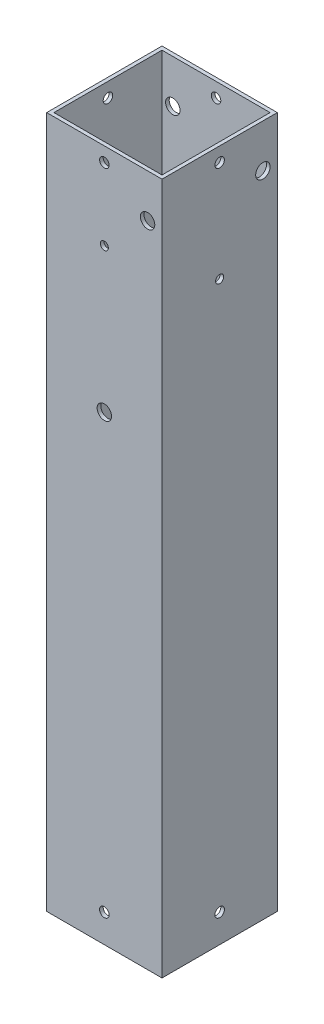
ISO-10303-21;
HEADER;
FILE_DESCRIPTION(('STEP AP214'),'2;1');
FILE_NAME('part.step','',(''),(''),'','','');
FILE_SCHEMA(('AUTOMOTIVE_DESIGN { 1 0 10303 214 1 1 1 1 }'));
ENDSEC;
DATA;
#1=APPLICATION_CONTEXT('core data for automotive mechanical design processes');
#2=APPLICATION_PROTOCOL_DEFINITION('international standard','automotive_design',2000,#1);
#3=PRODUCT_CONTEXT('',#1,'mechanical');
#4=PRODUCT('Part','Part','',(#3));
#5=PRODUCT_RELATED_PRODUCT_CATEGORY('part','',(#4));
#6=PRODUCT_DEFINITION_FORMATION('','',#4);
#7=PRODUCT_DEFINITION_CONTEXT('part definition',#1,'design');
#8=PRODUCT_DEFINITION('design','',#6,#7);
#9=PRODUCT_DEFINITION_SHAPE('','',#8);
#10=(LENGTH_UNIT() NAMED_UNIT(*) SI_UNIT(.MILLI.,.METRE.));
#11=(NAMED_UNIT(*) PLANE_ANGLE_UNIT() SI_UNIT($,.RADIAN.));
#12=(NAMED_UNIT(*) SI_UNIT($,.STERADIAN.) SOLID_ANGLE_UNIT());
#13=UNCERTAINTY_MEASURE_WITH_UNIT(LENGTH_MEASURE(1.E-05),#10,'distance_accuracy_value','');
#14=(GEOMETRIC_REPRESENTATION_CONTEXT(3) GLOBAL_UNCERTAINTY_ASSIGNED_CONTEXT((#13)) GLOBAL_UNIT_ASSIGNED_CONTEXT((#10,
#11,#12)) REPRESENTATION_CONTEXT('',''));
#15=CARTESIAN_POINT('',(0.,0.,0.));
#16=DIRECTION('',(0.,0.,1.));
#17=DIRECTION('',(1.,0.,0.));
#18=AXIS2_PLACEMENT_3D('',#15,#16,#17);
#19=CARTESIAN_POINT('',(0.,304.8,0.));
#20=DIRECTION('',(0.,1.,0.));
#21=DIRECTION('',(0.,0.,1.));
#22=AXIS2_PLACEMENT_3D('',#19,#20,#21);
#23=PLANE('',#22);
#24=DIRECTION('',(0.,0.,1.));
#25=VECTOR('',#24,1.);
#26=CARTESIAN_POINT('',(-25.4,304.8,-25.4));
#27=LINE('',#26,#25);
#28=CARTESIAN_POINT('',(-25.4,304.8,-25.4));
#29=VERTEX_POINT('',#28);
#30=CARTESIAN_POINT('',(-25.4,304.8,25.4));
#31=VERTEX_POINT('',#30);
#32=EDGE_CURVE('E165',#29,#31,#27,.T.);
#33=ORIENTED_EDGE('',*,*,#32,.T.);
#34=DIRECTION('',(1.,0.,0.));
#35=VECTOR('',#34,1.);
#36=CARTESIAN_POINT('',(-25.4,304.8,25.4));
#37=LINE('',#36,#35);
#38=CARTESIAN_POINT('',(25.4,304.8,25.4));
#39=VERTEX_POINT('',#38);
#40=EDGE_CURVE('E169',#31,#39,#37,.T.);
#41=ORIENTED_EDGE('',*,*,#40,.T.);
#42=DIRECTION('',(0.,0.,-1.));
#43=VECTOR('',#42,1.);
#44=CARTESIAN_POINT('',(25.4,304.8,-25.4));
#45=LINE('',#44,#43);
#46=CARTESIAN_POINT('',(25.4,304.8,-25.4));
#47=VERTEX_POINT('',#46);
#48=EDGE_CURVE('E173',#39,#47,#45,.T.);
#49=ORIENTED_EDGE('',*,*,#48,.T.);
#50=DIRECTION('',(-1.,0.,0.));
#51=VECTOR('',#50,1.);
#52=CARTESIAN_POINT('',(-25.4,304.8,-25.4));
#53=LINE('',#52,#51);
#54=EDGE_CURVE('E176',#47,#29,#53,.T.);
#55=ORIENTED_EDGE('',*,*,#54,.T.);
#56=EDGE_LOOP('',(#33,#41,#49,#55));
#57=FACE_BOUND('',#56,.T.);
#58=DIRECTION('',(1.,0.,0.));
#59=VECTOR('',#58,1.);
#60=CARTESIAN_POINT('',(-23.8125,304.8,23.8125));
#61=LINE('',#60,#59);
#62=CARTESIAN_POINT('',(-23.8125,304.8,23.8125));
#63=VERTEX_POINT('',#62);
#64=CARTESIAN_POINT('',(23.8125,304.8,23.8125));
#65=VERTEX_POINT('',#64);
#66=EDGE_CURVE('E122',#63,#65,#61,.T.);
#67=ORIENTED_EDGE('',*,*,#66,.F.);
#68=DIRECTION('',(0.,0.,1.));
#69=VECTOR('',#68,1.);
#70=CARTESIAN_POINT('',(-23.8125,304.8,-23.8125));
#71=LINE('',#70,#69);
#72=CARTESIAN_POINT('',(-23.8125,304.8,-23.8125));
#73=VERTEX_POINT('',#72);
#74=EDGE_CURVE('E113',#73,#63,#71,.T.);
#75=ORIENTED_EDGE('',*,*,#74,.F.);
#76=DIRECTION('',(-1.,0.,0.));
#77=VECTOR('',#76,1.);
#78=CARTESIAN_POINT('',(-23.8125,304.8,-23.8125));
#79=LINE('',#78,#77);
#80=CARTESIAN_POINT('',(23.8125,304.8,-23.8125));
#81=VERTEX_POINT('',#80);
#82=EDGE_CURVE('E141',#81,#73,#79,.T.);
#83=ORIENTED_EDGE('',*,*,#82,.F.);
#84=DIRECTION('',(0.,0.,-1.));
#85=VECTOR('',#84,1.);
#86=CARTESIAN_POINT('',(23.8125,304.8,-23.8125));
#87=LINE('',#86,#85);
#88=EDGE_CURVE('E135',#65,#81,#87,.T.);
#89=ORIENTED_EDGE('',*,*,#88,.F.);
#90=EDGE_LOOP('',(#67,#75,#83,#89));
#91=FACE_BOUND('',#90,.T.);
#92=ADVANCED_FACE('F45',(#57,#91),#23,.T.);
#93=CARTESIAN_POINT('',(0.,0.,0.));
#94=DIRECTION('',(0.,1.,0.));
#95=DIRECTION('',(0.,0.,1.));
#96=AXIS2_PLACEMENT_3D('',#93,#94,#95);
#97=PLANE('',#96);
#98=DIRECTION('',(0.,0.,1.));
#99=VECTOR('',#98,1.);
#100=CARTESIAN_POINT('',(-25.4,0.,-25.4));
#101=LINE('',#100,#99);
#102=CARTESIAN_POINT('',(-25.4,0.,-25.4));
#103=VERTEX_POINT('',#102);
#104=CARTESIAN_POINT('',(-25.4,0.,25.4));
#105=VERTEX_POINT('',#104);
#106=EDGE_CURVE('E131',#103,#105,#101,.T.);
#107=ORIENTED_EDGE('',*,*,#106,.F.);
#108=DIRECTION('',(-1.,0.,0.));
#109=VECTOR('',#108,1.);
#110=CARTESIAN_POINT('',(-25.4,0.,-25.4));
#111=LINE('',#110,#109);
#112=CARTESIAN_POINT('',(25.4,0.,-25.4));
#113=VERTEX_POINT('',#112);
#114=EDGE_CURVE('E170',#113,#103,#111,.T.);
#115=ORIENTED_EDGE('',*,*,#114,.F.);
#116=DIRECTION('',(0.,0.,-1.));
#117=VECTOR('',#116,1.);
#118=CARTESIAN_POINT('',(25.4,0.,-25.4));
#119=LINE('',#118,#117);
#120=CARTESIAN_POINT('',(25.4,0.,25.4));
#121=VERTEX_POINT('',#120);
#122=EDGE_CURVE('E186',#121,#113,#119,.T.);
#123=ORIENTED_EDGE('',*,*,#122,.F.);
#124=DIRECTION('',(1.,0.,0.));
#125=VECTOR('',#124,1.);
#126=CARTESIAN_POINT('',(-25.4,0.,25.4));
#127=LINE('',#126,#125);
#128=EDGE_CURVE('E183',#105,#121,#127,.T.);
#129=ORIENTED_EDGE('',*,*,#128,.F.);
#130=EDGE_LOOP('',(#107,#115,#123,#129));
#131=FACE_BOUND('',#130,.T.);
#132=DIRECTION('',(0.,0.,1.));
#133=VECTOR('',#132,1.);
#134=CARTESIAN_POINT('',(-23.8125,0.,-23.8125));
#135=LINE('',#134,#133);
#136=CARTESIAN_POINT('',(-23.8125,0.,-23.8125));
#137=VERTEX_POINT('',#136);
#138=CARTESIAN_POINT('',(-23.8125,0.,23.8125));
#139=VERTEX_POINT('',#138);
#140=EDGE_CURVE('E71',#137,#139,#135,.T.);
#141=ORIENTED_EDGE('',*,*,#140,.T.);
#142=DIRECTION('',(1.,0.,0.));
#143=VECTOR('',#142,1.);
#144=CARTESIAN_POINT('',(-23.8125,0.,23.8125));
#145=LINE('',#144,#143);
#146=CARTESIAN_POINT('',(23.8125,0.,23.8125));
#147=VERTEX_POINT('',#146);
#148=EDGE_CURVE('E129',#139,#147,#145,.T.);
#149=ORIENTED_EDGE('',*,*,#148,.T.);
#150=DIRECTION('',(0.,0.,-1.));
#151=VECTOR('',#150,1.);
#152=CARTESIAN_POINT('',(23.8125,0.,-23.8125));
#153=LINE('',#152,#151);
#154=CARTESIAN_POINT('',(23.8125,0.,-23.8125));
#155=VERTEX_POINT('',#154);
#156=EDGE_CURVE('E152',#147,#155,#153,.T.);
#157=ORIENTED_EDGE('',*,*,#156,.T.);
#158=DIRECTION('',(-1.,0.,0.));
#159=VECTOR('',#158,1.);
#160=CARTESIAN_POINT('',(-23.8125,0.,-23.8125));
#161=LINE('',#160,#159);
#162=EDGE_CURVE('E123',#155,#137,#161,.T.);
#163=ORIENTED_EDGE('',*,*,#162,.T.);
#164=EDGE_LOOP('',(#141,#149,#157,#163));
#165=FACE_BOUND('',#164,.T.);
#166=ADVANCED_FACE('F371',(#131,#165),#97,.F.);
#167=CARTESIAN_POINT('',(-25.4,304.8,-25.4));
#168=DIRECTION('',(1.,0.,0.));
#169=DIRECTION('',(0.,0.,-1.));
#170=AXIS2_PLACEMENT_3D('',#167,#168,#169);
#171=PLANE('',#170);
#172=CARTESIAN_POINT('',(-25.4,203.2,0.));
#173=DIRECTION('',(-1.,0.,0.));
#174=DIRECTION('',(0.,0.,1.));
#175=AXIS2_PLACEMENT_3D('',#172,#173,#174);
#176=CIRCLE('',#175,1.77799999999999);
#177=CARTESIAN_POINT('',(-25.4,203.2,1.77799999999999));
#178=VERTEX_POINT('',#177);
#179=EDGE_CURVE('E264',#178,#178,#176,.T.);
#180=ORIENTED_EDGE('',*,*,#179,.F.);
#181=EDGE_LOOP('',(#180));
#182=FACE_BOUND('',#181,.T.);
#183=CARTESIAN_POINT('',(-25.4,285.75,19.05));
#184=DIRECTION('',(-1.,0.,0.));
#185=DIRECTION('',(0.,0.,1.));
#186=AXIS2_PLACEMENT_3D('',#183,#184,#185);
#187=CIRCLE('',#186,3.175);
#188=CARTESIAN_POINT('',(-25.4,285.75,22.225));
#189=VERTEX_POINT('',#188);
#190=EDGE_CURVE('E235',#189,#189,#187,.T.);
#191=ORIENTED_EDGE('',*,*,#190,.F.);
#192=EDGE_LOOP('',(#191));
#193=FACE_BOUND('',#192,.T.);
#194=CARTESIAN_POINT('',(-25.4,298.45,0.));
#195=DIRECTION('',(1.,0.,0.));
#196=DIRECTION('',(0.,0.,-1.));
#197=AXIS2_PLACEMENT_3D('',#194,#195,#196);
#198=CIRCLE('',#197,2.0955);
#199=CARTESIAN_POINT('',(-25.4,298.45,-2.09549999999998));
#200=VERTEX_POINT('',#199);
#201=EDGE_CURVE('E218',#200,#200,#198,.T.);
#202=ORIENTED_EDGE('',*,*,#201,.T.);
#203=EDGE_LOOP('',(#202));
#204=FACE_BOUND('',#203,.T.);
#205=CARTESIAN_POINT('',(-25.4,12.412400118,0.));
#206=DIRECTION('',(1.,0.,0.));
#207=DIRECTION('',(0.,0.,-1.));
#208=AXIS2_PLACEMENT_3D('',#205,#206,#207);
#209=CIRCLE('',#208,2.0955);
#210=CARTESIAN_POINT('',(-25.4,12.412400118,-2.09549999999999));
#211=VERTEX_POINT('',#210);
#212=EDGE_CURVE('E206',#211,#211,#209,.T.);
#213=ORIENTED_EDGE('',*,*,#212,.T.);
#214=EDGE_LOOP('',(#213));
#215=FACE_BOUND('',#214,.T.);
#216=ORIENTED_EDGE('',*,*,#106,.T.);
#217=DIRECTION('',(0.,-1.,0.));
#218=VECTOR('',#217,1.);
#219=CARTESIAN_POINT('',(-25.4,304.8,25.4));
#220=LINE('',#219,#218);
#221=EDGE_CURVE('E11',#31,#105,#220,.T.);
#222=ORIENTED_EDGE('',*,*,#221,.F.);
#223=ORIENTED_EDGE('',*,*,#32,.F.);
#224=DIRECTION('',(0.,-1.,0.));
#225=VECTOR('',#224,1.);
#226=CARTESIAN_POINT('',(-25.4,304.8,-25.4));
#227=LINE('',#226,#225);
#228=EDGE_CURVE('E179',#29,#103,#227,.T.);
#229=ORIENTED_EDGE('',*,*,#228,.T.);
#230=EDGE_LOOP('',(#216,#222,#223,#229));
#231=FACE_BOUND('',#230,.T.);
#232=ADVANCED_FACE('F47',(#182,#193,#204,#215,#231),#171,.F.);
#233=CARTESIAN_POINT('',(-25.4,304.8,25.4));
#234=DIRECTION('',(0.,0.,-1.));
#235=DIRECTION('',(-1.,0.,0.));
#236=AXIS2_PLACEMENT_3D('',#233,#234,#235);
#237=PLANE('',#236);
#238=CARTESIAN_POINT('',(0.,266.7,25.4));
#239=DIRECTION('',(0.,0.,1.));
#240=DIRECTION('',(1.,0.,0.));
#241=AXIS2_PLACEMENT_3D('',#238,#239,#240);
#242=CIRCLE('',#241,1.77800000000001);
#243=CARTESIAN_POINT('',(1.77800000000001,266.7,25.4));
#244=VERTEX_POINT('',#243);
#245=EDGE_CURVE('E268',#244,#244,#242,.T.);
#246=ORIENTED_EDGE('',*,*,#245,.F.);
#247=EDGE_LOOP('',(#246));
#248=FACE_BOUND('',#247,.T.);
#249=CARTESIAN_POINT('',(0.,203.2,25.4));
#250=DIRECTION('',(0.,0.,1.));
#251=DIRECTION('',(1.,0.,0.));
#252=AXIS2_PLACEMENT_3D('',#249,#250,#251);
#253=CIRCLE('',#252,3.175);
#254=CARTESIAN_POINT('',(3.175,203.2,25.4));
#255=VERTEX_POINT('',#254);
#256=EDGE_CURVE('E277',#255,#255,#253,.T.);
#257=ORIENTED_EDGE('',*,*,#256,.F.);
#258=EDGE_LOOP('',(#257));
#259=FACE_BOUND('',#258,.T.);
#260=CARTESIAN_POINT('',(19.05,285.75,25.4));
#261=DIRECTION('',(0.,0.,1.));
#262=DIRECTION('',(1.,0.,0.));
#263=AXIS2_PLACEMENT_3D('',#260,#261,#262);
#264=CIRCLE('',#263,3.175);
#265=CARTESIAN_POINT('',(22.225,285.75,25.4));
#266=VERTEX_POINT('',#265);
#267=EDGE_CURVE('E230',#266,#266,#264,.T.);
#268=ORIENTED_EDGE('',*,*,#267,.F.);
#269=EDGE_LOOP('',(#268));
#270=FACE_BOUND('',#269,.T.);
#271=CARTESIAN_POINT('',(0.,298.45,25.4));
#272=DIRECTION('',(0.,0.,1.));
#273=DIRECTION('',(1.,0.,0.));
#274=AXIS2_PLACEMENT_3D('',#271,#272,#273);
#275=CIRCLE('',#274,2.0955);
#276=CARTESIAN_POINT('',(2.0955,298.45,25.4));
#277=VERTEX_POINT('',#276);
#278=EDGE_CURVE('E229',#277,#277,#275,.T.);
#279=ORIENTED_EDGE('',*,*,#278,.F.);
#280=EDGE_LOOP('',(#279));
#281=FACE_BOUND('',#280,.T.);
#282=CARTESIAN_POINT('',(0.,12.412400118,25.4));
#283=DIRECTION('',(0.,0.,-1.));
#284=DIRECTION('',(-1.,0.,0.));
#285=AXIS2_PLACEMENT_3D('',#282,#283,#284);
#286=CIRCLE('',#285,2.0955);
#287=CARTESIAN_POINT('',(-2.09550000000001,12.412400118,25.4));
#288=VERTEX_POINT('',#287);
#289=EDGE_CURVE('E212',#288,#288,#286,.T.);
#290=ORIENTED_EDGE('',*,*,#289,.T.);
#291=EDGE_LOOP('',(#290));
#292=FACE_BOUND('',#291,.T.);
#293=ORIENTED_EDGE('',*,*,#128,.T.);
#294=DIRECTION('',(0.,-1.,0.));
#295=VECTOR('',#294,1.);
#296=CARTESIAN_POINT('',(25.4,304.8,25.4));
#297=LINE('',#296,#295);
#298=EDGE_CURVE('E55',#39,#121,#297,.T.);
#299=ORIENTED_EDGE('',*,*,#298,.F.);
#300=ORIENTED_EDGE('',*,*,#40,.F.);
#301=ORIENTED_EDGE('',*,*,#221,.T.);
#302=EDGE_LOOP('',(#293,#299,#300,#301));
#303=FACE_BOUND('',#302,.T.);
#304=ADVANCED_FACE('F387',(#248,#259,#270,#281,#292,#303),#237,.F.);
#305=CARTESIAN_POINT('',(25.4,304.8,-25.4));
#306=DIRECTION('',(-1.,0.,0.));
#307=DIRECTION('',(0.,0.,1.));
#308=AXIS2_PLACEMENT_3D('',#305,#306,#307);
#309=PLANE('',#308);
#310=CARTESIAN_POINT('',(25.4,254.,0.));
#311=DIRECTION('',(1.,0.,0.));
#312=DIRECTION('',(0.,0.,-1.));
#313=AXIS2_PLACEMENT_3D('',#310,#311,#312);
#314=CIRCLE('',#313,1.77800000000001);
#315=CARTESIAN_POINT('',(25.4,254.,-1.77800000000002));
#316=VERTEX_POINT('',#315);
#317=EDGE_CURVE('E260',#316,#316,#314,.T.);
#318=ORIENTED_EDGE('',*,*,#317,.F.);
#319=EDGE_LOOP('',(#318));
#320=FACE_BOUND('',#319,.T.);
#321=CARTESIAN_POINT('',(25.4,285.75,-19.05));
#322=DIRECTION('',(1.,0.,0.));
#323=DIRECTION('',(0.,0.,-1.));
#324=AXIS2_PLACEMENT_3D('',#321,#322,#323);
#325=CIRCLE('',#324,3.175);
#326=CARTESIAN_POINT('',(25.4,285.75,-22.225));
#327=VERTEX_POINT('',#326);
#328=EDGE_CURVE('E245',#327,#327,#325,.T.);
#329=ORIENTED_EDGE('',*,*,#328,.F.);
#330=EDGE_LOOP('',(#329));
#331=FACE_BOUND('',#330,.T.);
#332=CARTESIAN_POINT('',(25.4,298.45,0.));
#333=DIRECTION('',(1.,0.,0.));
#334=DIRECTION('',(0.,0.,-1.));
#335=AXIS2_PLACEMENT_3D('',#332,#333,#334);
#336=CIRCLE('',#335,2.0955);
#337=CARTESIAN_POINT('',(25.4,298.45,-2.0955));
#338=VERTEX_POINT('',#337);
#339=EDGE_CURVE('E320',#338,#338,#336,.T.);
#340=ORIENTED_EDGE('',*,*,#339,.F.);
#341=EDGE_LOOP('',(#340));
#342=FACE_BOUND('',#341,.T.);
#343=CARTESIAN_POINT('',(25.4,12.412400118,0.));
#344=DIRECTION('',(-1.,0.,0.));
#345=DIRECTION('',(0.,0.,1.));
#346=AXIS2_PLACEMENT_3D('',#343,#344,#345);
#347=CIRCLE('',#346,2.0955);
#348=CARTESIAN_POINT('',(25.4,12.412400118,2.0955));
#349=VERTEX_POINT('',#348);
#350=EDGE_CURVE('E149',#349,#349,#347,.T.);
#351=ORIENTED_EDGE('',*,*,#350,.T.);
#352=EDGE_LOOP('',(#351));
#353=FACE_BOUND('',#352,.T.);
#354=ORIENTED_EDGE('',*,*,#122,.T.);
#355=DIRECTION('',(0.,-1.,0.));
#356=VECTOR('',#355,1.);
#357=CARTESIAN_POINT('',(25.4,304.8,-25.4));
#358=LINE('',#357,#356);
#359=EDGE_CURVE('E194',#47,#113,#358,.T.);
#360=ORIENTED_EDGE('',*,*,#359,.F.);
#361=ORIENTED_EDGE('',*,*,#48,.F.);
#362=ORIENTED_EDGE('',*,*,#298,.T.);
#363=EDGE_LOOP('',(#354,#360,#361,#362));
#364=FACE_BOUND('',#363,.T.);
#365=ADVANCED_FACE('F351',(#320,#331,#342,#353,#364),#309,.F.);
#366=CARTESIAN_POINT('',(-25.4,304.8,-25.4));
#367=DIRECTION('',(0.,0.,1.));
#368=DIRECTION('',(1.,0.,0.));
#369=AXIS2_PLACEMENT_3D('',#366,#367,#368);
#370=PLANE('',#369);
#371=CARTESIAN_POINT('',(0.,222.25,-25.4));
#372=DIRECTION('',(0.,0.,-1.));
#373=DIRECTION('',(-1.,0.,0.));
#374=AXIS2_PLACEMENT_3D('',#371,#372,#373);
#375=CIRCLE('',#374,1.778);
#376=CARTESIAN_POINT('',(-1.778,222.25,-25.4));
#377=VERTEX_POINT('',#376);
#378=EDGE_CURVE('E251',#377,#377,#375,.T.);
#379=ORIENTED_EDGE('',*,*,#378,.F.);
#380=EDGE_LOOP('',(#379));
#381=FACE_BOUND('',#380,.T.);
#382=CARTESIAN_POINT('',(0.,190.5,-25.4));
#383=DIRECTION('',(0.,0.,-1.));
#384=DIRECTION('',(-1.,0.,0.));
#385=AXIS2_PLACEMENT_3D('',#382,#383,#384);
#386=CIRCLE('',#385,3.175);
#387=CARTESIAN_POINT('',(-3.175,190.5,-25.4));
#388=VERTEX_POINT('',#387);
#389=EDGE_CURVE('E259',#388,#388,#386,.T.);
#390=ORIENTED_EDGE('',*,*,#389,.F.);
#391=EDGE_LOOP('',(#390));
#392=FACE_BOUND('',#391,.T.);
#393=CARTESIAN_POINT('',(-19.05,285.75,-25.4));
#394=DIRECTION('',(0.,0.,-1.));
#395=DIRECTION('',(-1.,0.,0.));
#396=AXIS2_PLACEMENT_3D('',#393,#394,#395);
#397=CIRCLE('',#396,3.175);
#398=CARTESIAN_POINT('',(-22.225,285.75,-25.4));
#399=VERTEX_POINT('',#398);
#400=EDGE_CURVE('E240',#399,#399,#397,.T.);
#401=ORIENTED_EDGE('',*,*,#400,.F.);
#402=EDGE_LOOP('',(#401));
#403=FACE_BOUND('',#402,.T.);
#404=CARTESIAN_POINT('',(0.,298.45,-25.4));
#405=DIRECTION('',(0.,0.,1.));
#406=DIRECTION('',(1.,0.,0.));
#407=AXIS2_PLACEMENT_3D('',#404,#405,#406);
#408=CIRCLE('',#407,2.0955);
#409=CARTESIAN_POINT('',(2.0955,298.45,-25.4));
#410=VERTEX_POINT('',#409);
#411=EDGE_CURVE('E224',#410,#410,#408,.T.);
#412=ORIENTED_EDGE('',*,*,#411,.T.);
#413=EDGE_LOOP('',(#412));
#414=FACE_BOUND('',#413,.T.);
#415=CARTESIAN_POINT('',(0.,12.412400118,-25.4));
#416=DIRECTION('',(0.,0.,-1.));
#417=DIRECTION('',(-1.,0.,0.));
#418=AXIS2_PLACEMENT_3D('',#415,#416,#417);
#419=CIRCLE('',#418,2.0955);
#420=CARTESIAN_POINT('',(-2.09550000000001,12.412400118,-25.4));
#421=VERTEX_POINT('',#420);
#422=EDGE_CURVE('E330',#421,#421,#419,.T.);
#423=ORIENTED_EDGE('',*,*,#422,.F.);
#424=EDGE_LOOP('',(#423));
#425=FACE_BOUND('',#424,.T.);
#426=ORIENTED_EDGE('',*,*,#114,.T.);
#427=ORIENTED_EDGE('',*,*,#228,.F.);
#428=ORIENTED_EDGE('',*,*,#54,.F.);
#429=ORIENTED_EDGE('',*,*,#359,.T.);
#430=EDGE_LOOP('',(#426,#427,#428,#429));
#431=FACE_BOUND('',#430,.T.);
#432=ADVANCED_FACE('F382',(#381,#392,#403,#414,#425,#431),#370,.F.);
#433=CARTESIAN_POINT('',(-23.8125,304.8,-23.8125));
#434=DIRECTION('',(1.,0.,0.));
#435=DIRECTION('',(0.,0.,-1.));
#436=AXIS2_PLACEMENT_3D('',#433,#434,#435);
#437=PLANE('',#436);
#438=CARTESIAN_POINT('',(-23.8125,203.2,0.));
#439=DIRECTION('',(1.,0.,0.));
#440=DIRECTION('',(0.,0.,-1.));
#441=AXIS2_PLACEMENT_3D('',#438,#439,#440);
#442=CIRCLE('',#441,1.77799999999999);
#443=CARTESIAN_POINT('',(-23.8125,203.2,-1.77799999999999));
#444=VERTEX_POINT('',#443);
#445=EDGE_CURVE('E261',#444,#444,#442,.T.);
#446=ORIENTED_EDGE('',*,*,#445,.F.);
#447=EDGE_LOOP('',(#446));
#448=FACE_BOUND('',#447,.T.);
#449=CARTESIAN_POINT('',(-23.8125,285.75,19.05));
#450=DIRECTION('',(1.,0.,0.));
#451=DIRECTION('',(0.,0.,-1.));
#452=AXIS2_PLACEMENT_3D('',#449,#450,#451);
#453=CIRCLE('',#452,3.175);
#454=CARTESIAN_POINT('',(-23.8125,285.75,15.875));
#455=VERTEX_POINT('',#454);
#456=EDGE_CURVE('E231',#455,#455,#453,.T.);
#457=ORIENTED_EDGE('',*,*,#456,.F.);
#458=EDGE_LOOP('',(#457));
#459=FACE_BOUND('',#458,.T.);
#460=CARTESIAN_POINT('',(-23.8125,298.45,0.));
#461=DIRECTION('',(1.,0.,0.));
#462=DIRECTION('',(0.,0.,-1.));
#463=AXIS2_PLACEMENT_3D('',#460,#461,#462);
#464=CIRCLE('',#463,2.0955);
#465=CARTESIAN_POINT('',(-23.8125,298.45,-2.09549999999998));
#466=VERTEX_POINT('',#465);
#467=EDGE_CURVE('E217',#466,#466,#464,.T.);
#468=ORIENTED_EDGE('',*,*,#467,.F.);
#469=EDGE_LOOP('',(#468));
#470=FACE_BOUND('',#469,.T.);
#471=CARTESIAN_POINT('',(-23.8125,12.412400118,0.));
#472=DIRECTION('',(1.,0.,0.));
#473=DIRECTION('',(0.,0.,-1.));
#474=AXIS2_PLACEMENT_3D('',#471,#472,#473);
#475=CIRCLE('',#474,2.0955);
#476=CARTESIAN_POINT('',(-23.8125,12.412400118,-2.0955));
#477=VERTEX_POINT('',#476);
#478=EDGE_CURVE('E205',#477,#477,#475,.T.);
#479=ORIENTED_EDGE('',*,*,#478,.F.);
#480=EDGE_LOOP('',(#479));
#481=FACE_BOUND('',#480,.T.);
#482=ORIENTED_EDGE('',*,*,#140,.F.);
#483=DIRECTION('',(0.,-1.,0.));
#484=VECTOR('',#483,1.);
#485=CARTESIAN_POINT('',(-23.8125,304.8,-23.8125));
#486=LINE('',#485,#484);
#487=EDGE_CURVE('E117',#73,#137,#486,.T.);
#488=ORIENTED_EDGE('',*,*,#487,.F.);
#489=ORIENTED_EDGE('',*,*,#74,.T.);
#490=DIRECTION('',(0.,-1.,0.));
#491=VECTOR('',#490,1.);
#492=CARTESIAN_POINT('',(-23.8125,304.8,23.8125));
#493=LINE('',#492,#491);
#494=EDGE_CURVE('E116',#63,#139,#493,.T.);
#495=ORIENTED_EDGE('',*,*,#494,.T.);
#496=EDGE_LOOP('',(#482,#488,#489,#495));
#497=FACE_BOUND('',#496,.T.);
#498=ADVANCED_FACE('F115',(#448,#459,#470,#481,#497),#437,.T.);
#499=CARTESIAN_POINT('',(-23.8125,304.8,23.8125));
#500=DIRECTION('',(0.,0.,-1.));
#501=DIRECTION('',(-1.,0.,0.));
#502=AXIS2_PLACEMENT_3D('',#499,#500,#501);
#503=PLANE('',#502);
#504=CARTESIAN_POINT('',(0.,266.7,23.8125));
#505=DIRECTION('',(0.,0.,-1.));
#506=DIRECTION('',(-1.,0.,0.));
#507=AXIS2_PLACEMENT_3D('',#504,#505,#506);
#508=CIRCLE('',#507,1.77800000000001);
#509=CARTESIAN_POINT('',(-1.77800000000001,266.7,23.8125));
#510=VERTEX_POINT('',#509);
#511=EDGE_CURVE('E49',#510,#510,#508,.T.);
#512=ORIENTED_EDGE('',*,*,#511,.F.);
#513=EDGE_LOOP('',(#512));
#514=FACE_BOUND('',#513,.T.);
#515=CARTESIAN_POINT('',(0.,203.2,23.8125));
#516=DIRECTION('',(0.,0.,-1.));
#517=DIRECTION('',(-1.,0.,0.));
#518=AXIS2_PLACEMENT_3D('',#515,#516,#517);
#519=CIRCLE('',#518,3.175);
#520=CARTESIAN_POINT('',(-3.175,203.2,23.8125));
#521=VERTEX_POINT('',#520);
#522=EDGE_CURVE('E265',#521,#521,#519,.T.);
#523=ORIENTED_EDGE('',*,*,#522,.F.);
#524=EDGE_LOOP('',(#523));
#525=FACE_BOUND('',#524,.T.);
#526=CARTESIAN_POINT('',(19.05,285.75,23.8125));
#527=DIRECTION('',(0.,0.,-1.));
#528=DIRECTION('',(-1.,0.,0.));
#529=AXIS2_PLACEMENT_3D('',#526,#527,#528);
#530=CIRCLE('',#529,3.175);
#531=CARTESIAN_POINT('',(15.875,285.75,23.8125));
#532=VERTEX_POINT('',#531);
#533=EDGE_CURVE('E225',#532,#532,#530,.T.);
#534=ORIENTED_EDGE('',*,*,#533,.F.);
#535=EDGE_LOOP('',(#534));
#536=FACE_BOUND('',#535,.T.);
#537=CARTESIAN_POINT('',(0.,298.45,23.8125));
#538=DIRECTION('',(0.,0.,-1.));
#539=DIRECTION('',(-1.,0.,0.));
#540=AXIS2_PLACEMENT_3D('',#537,#538,#539);
#541=CIRCLE('',#540,2.0955);
#542=CARTESIAN_POINT('',(-2.0955,298.45,23.8125));
#543=VERTEX_POINT('',#542);
#544=EDGE_CURVE('E223',#543,#543,#541,.T.);
#545=ORIENTED_EDGE('',*,*,#544,.F.);
#546=EDGE_LOOP('',(#545));
#547=FACE_BOUND('',#546,.T.);
#548=CARTESIAN_POINT('',(0.,12.412400118,23.8125));
#549=DIRECTION('',(0.,0.,-1.));
#550=DIRECTION('',(-1.,0.,0.));
#551=AXIS2_PLACEMENT_3D('',#548,#549,#550);
#552=CIRCLE('',#551,2.0955);
#553=CARTESIAN_POINT('',(-2.09550000000001,12.412400118,23.8125));
#554=VERTEX_POINT('',#553);
#555=EDGE_CURVE('E211',#554,#554,#552,.T.);
#556=ORIENTED_EDGE('',*,*,#555,.F.);
#557=EDGE_LOOP('',(#556));
#558=FACE_BOUND('',#557,.T.);
#559=ORIENTED_EDGE('',*,*,#148,.F.);
#560=ORIENTED_EDGE('',*,*,#494,.F.);
#561=ORIENTED_EDGE('',*,*,#66,.T.);
#562=DIRECTION('',(0.,-1.,0.));
#563=VECTOR('',#562,1.);
#564=CARTESIAN_POINT('',(23.8125,304.8,23.8125));
#565=LINE('',#564,#563);
#566=EDGE_CURVE('E132',#65,#147,#565,.T.);
#567=ORIENTED_EDGE('',*,*,#566,.T.);
#568=EDGE_LOOP('',(#559,#560,#561,#567));
#569=FACE_BOUND('',#568,.T.);
#570=ADVANCED_FACE('F126',(#514,#525,#536,#547,#558,#569),#503,.T.);
#571=CARTESIAN_POINT('',(23.8125,304.8,-23.8125));
#572=DIRECTION('',(-1.,0.,0.));
#573=DIRECTION('',(0.,0.,1.));
#574=AXIS2_PLACEMENT_3D('',#571,#572,#573);
#575=PLANE('',#574);
#576=CARTESIAN_POINT('',(23.8125,254.,0.));
#577=DIRECTION('',(-1.,0.,0.));
#578=DIRECTION('',(0.,0.,1.));
#579=AXIS2_PLACEMENT_3D('',#576,#577,#578);
#580=CIRCLE('',#579,1.77800000000001);
#581=CARTESIAN_POINT('',(23.8125,254.,1.77800000000001));
#582=VERTEX_POINT('',#581);
#583=EDGE_CURVE('E255',#582,#582,#580,.T.);
#584=ORIENTED_EDGE('',*,*,#583,.F.);
#585=EDGE_LOOP('',(#584));
#586=FACE_BOUND('',#585,.T.);
#587=CARTESIAN_POINT('',(23.8125,285.75,-19.05));
#588=DIRECTION('',(-1.,0.,0.));
#589=DIRECTION('',(0.,0.,1.));
#590=AXIS2_PLACEMENT_3D('',#587,#588,#589);
#591=CIRCLE('',#590,3.175);
#592=CARTESIAN_POINT('',(23.8125,285.75,-15.875));
#593=VERTEX_POINT('',#592);
#594=EDGE_CURVE('E241',#593,#593,#591,.T.);
#595=ORIENTED_EDGE('',*,*,#594,.F.);
#596=EDGE_LOOP('',(#595));
#597=FACE_BOUND('',#596,.T.);
#598=CARTESIAN_POINT('',(23.8125,298.45,0.));
#599=DIRECTION('',(-1.,0.,0.));
#600=DIRECTION('',(0.,0.,1.));
#601=AXIS2_PLACEMENT_3D('',#598,#599,#600);
#602=CIRCLE('',#601,2.0955);
#603=CARTESIAN_POINT('',(23.8125,298.45,2.0955));
#604=VERTEX_POINT('',#603);
#605=EDGE_CURVE('E213',#604,#604,#602,.T.);
#606=ORIENTED_EDGE('',*,*,#605,.F.);
#607=EDGE_LOOP('',(#606));
#608=FACE_BOUND('',#607,.T.);
#609=CARTESIAN_POINT('',(23.8125,12.412400118,0.));
#610=DIRECTION('',(-1.,0.,0.));
#611=DIRECTION('',(0.,0.,1.));
#612=AXIS2_PLACEMENT_3D('',#609,#610,#611);
#613=CIRCLE('',#612,2.0955);
#614=CARTESIAN_POINT('',(23.8125,12.412400118,2.0955));
#615=VERTEX_POINT('',#614);
#616=EDGE_CURVE('E201',#615,#615,#613,.T.);
#617=ORIENTED_EDGE('',*,*,#616,.F.);
#618=EDGE_LOOP('',(#617));
#619=FACE_BOUND('',#618,.T.);
#620=ORIENTED_EDGE('',*,*,#156,.F.);
#621=ORIENTED_EDGE('',*,*,#566,.F.);
#622=ORIENTED_EDGE('',*,*,#88,.T.);
#623=DIRECTION('',(0.,-1.,0.));
#624=VECTOR('',#623,1.);
#625=CARTESIAN_POINT('',(23.8125,304.8,-23.8125));
#626=LINE('',#625,#624);
#627=EDGE_CURVE('E63',#81,#155,#626,.T.);
#628=ORIENTED_EDGE('',*,*,#627,.T.);
#629=EDGE_LOOP('',(#620,#621,#622,#628));
#630=FACE_BOUND('',#629,.T.);
#631=ADVANCED_FACE('F366',(#586,#597,#608,#619,#630),#575,.T.);
#632=CARTESIAN_POINT('',(-23.8125,304.8,-23.8125));
#633=DIRECTION('',(0.,0.,1.));
#634=DIRECTION('',(1.,0.,0.));
#635=AXIS2_PLACEMENT_3D('',#632,#633,#634);
#636=PLANE('',#635);
#637=CARTESIAN_POINT('',(0.,222.25,-23.8125));
#638=DIRECTION('',(0.,0.,1.));
#639=DIRECTION('',(1.,0.,0.));
#640=AXIS2_PLACEMENT_3D('',#637,#638,#639);
#641=CIRCLE('',#640,1.778);
#642=CARTESIAN_POINT('',(1.778,222.25,-23.8125));
#643=VERTEX_POINT('',#642);
#644=EDGE_CURVE('E250',#643,#643,#641,.T.);
#645=ORIENTED_EDGE('',*,*,#644,.F.);
#646=EDGE_LOOP('',(#645));
#647=FACE_BOUND('',#646,.T.);
#648=CARTESIAN_POINT('',(0.,190.5,-23.8125));
#649=DIRECTION('',(0.,0.,1.));
#650=DIRECTION('',(1.,0.,0.));
#651=AXIS2_PLACEMENT_3D('',#648,#649,#650);
#652=CIRCLE('',#651,3.175);
#653=CARTESIAN_POINT('',(3.175,190.5,-23.8125));
#654=VERTEX_POINT('',#653);
#655=EDGE_CURVE('E246',#654,#654,#652,.T.);
#656=ORIENTED_EDGE('',*,*,#655,.F.);
#657=EDGE_LOOP('',(#656));
#658=FACE_BOUND('',#657,.T.);
#659=CARTESIAN_POINT('',(-19.05,285.75,-23.8125));
#660=DIRECTION('',(0.,0.,1.));
#661=DIRECTION('',(1.,0.,0.));
#662=AXIS2_PLACEMENT_3D('',#659,#660,#661);
#663=CIRCLE('',#662,3.175);
#664=CARTESIAN_POINT('',(-15.875,285.75,-23.8125));
#665=VERTEX_POINT('',#664);
#666=EDGE_CURVE('E236',#665,#665,#663,.T.);
#667=ORIENTED_EDGE('',*,*,#666,.F.);
#668=EDGE_LOOP('',(#667));
#669=FACE_BOUND('',#668,.T.);
#670=CARTESIAN_POINT('',(0.,298.45,-23.8125));
#671=DIRECTION('',(0.,0.,1.));
#672=DIRECTION('',(1.,0.,0.));
#673=AXIS2_PLACEMENT_3D('',#670,#671,#672);
#674=CIRCLE('',#673,2.0955);
#675=CARTESIAN_POINT('',(2.0955,298.45,-23.8125));
#676=VERTEX_POINT('',#675);
#677=EDGE_CURVE('E219',#676,#676,#674,.T.);
#678=ORIENTED_EDGE('',*,*,#677,.F.);
#679=EDGE_LOOP('',(#678));
#680=FACE_BOUND('',#679,.T.);
#681=CARTESIAN_POINT('',(0.,12.412400118,-23.8125));
#682=DIRECTION('',(0.,0.,1.));
#683=DIRECTION('',(1.,0.,0.));
#684=AXIS2_PLACEMENT_3D('',#681,#682,#683);
#685=CIRCLE('',#684,2.0955);
#686=CARTESIAN_POINT('',(2.09549999999999,12.412400118,-23.8125));
#687=VERTEX_POINT('',#686);
#688=EDGE_CURVE('E207',#687,#687,#685,.T.);
#689=ORIENTED_EDGE('',*,*,#688,.F.);
#690=EDGE_LOOP('',(#689));
#691=FACE_BOUND('',#690,.T.);
#692=ORIENTED_EDGE('',*,*,#162,.F.);
#693=ORIENTED_EDGE('',*,*,#627,.F.);
#694=ORIENTED_EDGE('',*,*,#82,.T.);
#695=ORIENTED_EDGE('',*,*,#487,.T.);
#696=EDGE_LOOP('',(#692,#693,#694,#695));
#697=FACE_BOUND('',#696,.T.);
#698=ADVANCED_FACE('F357',(#647,#658,#669,#680,#691,#697),#636,.T.);
#699=CARTESIAN_POINT('',(-25.4,12.412400118,0.));
#700=DIRECTION('',(1.,0.,0.));
#701=DIRECTION('',(0.,0.,-1.));
#702=AXIS2_PLACEMENT_3D('',#699,#700,#701);
#703=CYLINDRICAL_SURFACE('',#702,2.0955);
#704=ORIENTED_EDGE('',*,*,#616,.T.);
#705=EDGE_LOOP('',(#704));
#706=FACE_BOUND('',#705,.T.);
#707=ORIENTED_EDGE('',*,*,#350,.F.);
#708=EDGE_LOOP('',(#707));
#709=FACE_BOUND('',#708,.T.);
#710=ADVANCED_FACE('F354',(#706,#709),#703,.F.);
#711=ORIENTED_EDGE('',*,*,#478,.T.);
#712=EDGE_LOOP('',(#711));
#713=FACE_BOUND('',#712,.T.);
#714=ORIENTED_EDGE('',*,*,#212,.F.);
#715=EDGE_LOOP('',(#714));
#716=FACE_BOUND('',#715,.T.);
#717=ADVANCED_FACE('F356',(#713,#716),#703,.F.);
#718=CARTESIAN_POINT('',(0.,12.412400118,25.4));
#719=DIRECTION('',(0.,0.,-1.));
#720=DIRECTION('',(-1.,0.,0.));
#721=AXIS2_PLACEMENT_3D('',#718,#719,#720);
#722=CYLINDRICAL_SURFACE('',#721,2.0955);
#723=ORIENTED_EDGE('',*,*,#688,.T.);
#724=EDGE_LOOP('',(#723));
#725=FACE_BOUND('',#724,.T.);
#726=ORIENTED_EDGE('',*,*,#422,.T.);
#727=EDGE_LOOP('',(#726));
#728=FACE_BOUND('',#727,.T.);
#729=ADVANCED_FACE('F364',(#725,#728),#722,.F.);
#730=ORIENTED_EDGE('',*,*,#555,.T.);
#731=EDGE_LOOP('',(#730));
#732=FACE_BOUND('',#731,.T.);
#733=ORIENTED_EDGE('',*,*,#289,.F.);
#734=EDGE_LOOP('',(#733));
#735=FACE_BOUND('',#734,.T.);
#736=ADVANCED_FACE('F438',(#732,#735),#722,.F.);
#737=CARTESIAN_POINT('',(-25.4,298.45,0.));
#738=DIRECTION('',(1.,0.,0.));
#739=DIRECTION('',(0.,0.,-1.));
#740=AXIS2_PLACEMENT_3D('',#737,#738,#739);
#741=CYLINDRICAL_SURFACE('',#740,2.0955);
#742=ORIENTED_EDGE('',*,*,#605,.T.);
#743=EDGE_LOOP('',(#742));
#744=FACE_BOUND('',#743,.T.);
#745=ORIENTED_EDGE('',*,*,#339,.T.);
#746=EDGE_LOOP('',(#745));
#747=FACE_BOUND('',#746,.T.);
#748=ADVANCED_FACE('F434',(#744,#747),#741,.F.);
#749=ORIENTED_EDGE('',*,*,#467,.T.);
#750=EDGE_LOOP('',(#749));
#751=FACE_BOUND('',#750,.T.);
#752=ORIENTED_EDGE('',*,*,#201,.F.);
#753=EDGE_LOOP('',(#752));
#754=FACE_BOUND('',#753,.T.);
#755=ADVANCED_FACE('F437',(#751,#754),#741,.F.);
#756=CARTESIAN_POINT('',(0.,298.45,-25.4));
#757=DIRECTION('',(0.,0.,1.));
#758=DIRECTION('',(1.,0.,0.));
#759=AXIS2_PLACEMENT_3D('',#756,#757,#758);
#760=CYLINDRICAL_SURFACE('',#759,2.0955);
#761=ORIENTED_EDGE('',*,*,#677,.T.);
#762=EDGE_LOOP('',(#761));
#763=FACE_BOUND('',#762,.T.);
#764=ORIENTED_EDGE('',*,*,#411,.F.);
#765=EDGE_LOOP('',(#764));
#766=FACE_BOUND('',#765,.T.);
#767=ADVANCED_FACE('F446',(#763,#766),#760,.F.);
#768=ORIENTED_EDGE('',*,*,#544,.T.);
#769=EDGE_LOOP('',(#768));
#770=FACE_BOUND('',#769,.T.);
#771=ORIENTED_EDGE('',*,*,#278,.T.);
#772=EDGE_LOOP('',(#771));
#773=FACE_BOUND('',#772,.T.);
#774=ADVANCED_FACE('F488',(#770,#773),#760,.F.);
#775=CARTESIAN_POINT('',(19.05,285.75,20.32));
#776=DIRECTION('',(0.,0.,1.));
#777=DIRECTION('',(1.,0.,0.));
#778=AXIS2_PLACEMENT_3D('',#775,#776,#777);
#779=CYLINDRICAL_SURFACE('',#778,3.175);
#780=ORIENTED_EDGE('',*,*,#533,.T.);
#781=EDGE_LOOP('',(#780));
#782=FACE_BOUND('',#781,.T.);
#783=ORIENTED_EDGE('',*,*,#267,.T.);
#784=EDGE_LOOP('',(#783));
#785=FACE_BOUND('',#784,.T.);
#786=ADVANCED_FACE('F498',(#782,#785),#779,.F.);
#787=CARTESIAN_POINT('',(-20.32,285.75,19.05));
#788=DIRECTION('',(-1.,0.,0.));
#789=DIRECTION('',(0.,0.,1.));
#790=AXIS2_PLACEMENT_3D('',#787,#788,#789);
#791=CYLINDRICAL_SURFACE('',#790,3.175);
#792=ORIENTED_EDGE('',*,*,#456,.T.);
#793=EDGE_LOOP('',(#792));
#794=FACE_BOUND('',#793,.T.);
#795=ORIENTED_EDGE('',*,*,#190,.T.);
#796=EDGE_LOOP('',(#795));
#797=FACE_BOUND('',#796,.T.);
#798=ADVANCED_FACE('F508',(#794,#797),#791,.F.);
#799=CARTESIAN_POINT('',(-19.05,285.75,-20.32));
#800=DIRECTION('',(0.,0.,-1.));
#801=DIRECTION('',(-1.,0.,0.));
#802=AXIS2_PLACEMENT_3D('',#799,#800,#801);
#803=CYLINDRICAL_SURFACE('',#802,3.175);
#804=ORIENTED_EDGE('',*,*,#666,.T.);
#805=EDGE_LOOP('',(#804));
#806=FACE_BOUND('',#805,.T.);
#807=ORIENTED_EDGE('',*,*,#400,.T.);
#808=EDGE_LOOP('',(#807));
#809=FACE_BOUND('',#808,.T.);
#810=ADVANCED_FACE('F518',(#806,#809),#803,.F.);
#811=CARTESIAN_POINT('',(20.32,285.75,-19.05));
#812=DIRECTION('',(1.,0.,0.));
#813=DIRECTION('',(0.,0.,-1.));
#814=AXIS2_PLACEMENT_3D('',#811,#812,#813);
#815=CYLINDRICAL_SURFACE('',#814,3.175);
#816=ORIENTED_EDGE('',*,*,#594,.T.);
#817=EDGE_LOOP('',(#816));
#818=FACE_BOUND('',#817,.T.);
#819=ORIENTED_EDGE('',*,*,#328,.T.);
#820=EDGE_LOOP('',(#819));
#821=FACE_BOUND('',#820,.T.);
#822=ADVANCED_FACE('F529',(#818,#821),#815,.F.);
#823=CARTESIAN_POINT('',(0.,190.5,-20.32));
#824=DIRECTION('',(0.,0.,-1.));
#825=DIRECTION('',(-1.,0.,0.));
#826=AXIS2_PLACEMENT_3D('',#823,#824,#825);
#827=CYLINDRICAL_SURFACE('',#826,3.175);
#828=ORIENTED_EDGE('',*,*,#655,.T.);
#829=EDGE_LOOP('',(#828));
#830=FACE_BOUND('',#829,.T.);
#831=ORIENTED_EDGE('',*,*,#389,.T.);
#832=EDGE_LOOP('',(#831));
#833=FACE_BOUND('',#832,.T.);
#834=ADVANCED_FACE('F540',(#830,#833),#827,.F.);
#835=CARTESIAN_POINT('',(0.,222.25,-20.32));
#836=DIRECTION('',(0.,0.,-1.));
#837=DIRECTION('',(-1.,0.,0.));
#838=AXIS2_PLACEMENT_3D('',#835,#836,#837);
#839=CYLINDRICAL_SURFACE('',#838,1.778);
#840=ORIENTED_EDGE('',*,*,#644,.T.);
#841=EDGE_LOOP('',(#840));
#842=FACE_BOUND('',#841,.T.);
#843=ORIENTED_EDGE('',*,*,#378,.T.);
#844=EDGE_LOOP('',(#843));
#845=FACE_BOUND('',#844,.T.);
#846=ADVANCED_FACE('F570',(#842,#845),#839,.F.);
#847=CARTESIAN_POINT('',(20.32,254.,0.));
#848=DIRECTION('',(1.,0.,0.));
#849=DIRECTION('',(0.,0.,-1.));
#850=AXIS2_PLACEMENT_3D('',#847,#848,#849);
#851=CYLINDRICAL_SURFACE('',#850,1.77800000000001);
#852=ORIENTED_EDGE('',*,*,#583,.T.);
#853=EDGE_LOOP('',(#852));
#854=FACE_BOUND('',#853,.T.);
#855=ORIENTED_EDGE('',*,*,#317,.T.);
#856=EDGE_LOOP('',(#855));
#857=FACE_BOUND('',#856,.T.);
#858=ADVANCED_FACE('F581',(#854,#857),#851,.F.);
#859=CARTESIAN_POINT('',(-20.32,203.2,0.));
#860=DIRECTION('',(-1.,0.,0.));
#861=DIRECTION('',(0.,0.,1.));
#862=AXIS2_PLACEMENT_3D('',#859,#860,#861);
#863=CYLINDRICAL_SURFACE('',#862,1.77799999999999);
#864=ORIENTED_EDGE('',*,*,#445,.T.);
#865=EDGE_LOOP('',(#864));
#866=FACE_BOUND('',#865,.T.);
#867=ORIENTED_EDGE('',*,*,#179,.T.);
#868=EDGE_LOOP('',(#867));
#869=FACE_BOUND('',#868,.T.);
#870=ADVANCED_FACE('F604',(#866,#869),#863,.F.);
#871=CARTESIAN_POINT('',(0.,203.2,20.32));
#872=DIRECTION('',(0.,0.,1.));
#873=DIRECTION('',(1.,0.,0.));
#874=AXIS2_PLACEMENT_3D('',#871,#872,#873);
#875=CYLINDRICAL_SURFACE('',#874,3.175);
#876=ORIENTED_EDGE('',*,*,#522,.T.);
#877=EDGE_LOOP('',(#876));
#878=FACE_BOUND('',#877,.T.);
#879=ORIENTED_EDGE('',*,*,#256,.T.);
#880=EDGE_LOOP('',(#879));
#881=FACE_BOUND('',#880,.T.);
#882=ADVANCED_FACE('F629',(#878,#881),#875,.F.);
#883=CARTESIAN_POINT('',(0.,266.7,20.32));
#884=DIRECTION('',(0.,0.,1.));
#885=DIRECTION('',(1.,0.,0.));
#886=AXIS2_PLACEMENT_3D('',#883,#884,#885);
#887=CYLINDRICAL_SURFACE('',#886,1.77800000000001);
#888=ORIENTED_EDGE('',*,*,#511,.T.);
#889=EDGE_LOOP('',(#888));
#890=FACE_BOUND('',#889,.T.);
#891=ORIENTED_EDGE('',*,*,#245,.T.);
#892=EDGE_LOOP('',(#891));
#893=FACE_BOUND('',#892,.T.);
#894=ADVANCED_FACE('F651',(#890,#893),#887,.F.);
#895=CLOSED_SHELL('',(#92,#166,#232,#304,#365,#432,#498,#570,#631,#698,#710,#717,#729,#736,#748,
#755,#767,#774,#786,#798,#810,#822,#834,#846,#858,#870,#882,#894));
#896=MANIFOLD_SOLID_BREP('B2',#895);
#897=ADVANCED_BREP_SHAPE_REPRESENTATION('',(#18,#896),#14);
#898=SHAPE_DEFINITION_REPRESENTATION(#9,#897);
ENDSEC;
END-ISO-10303-21;
